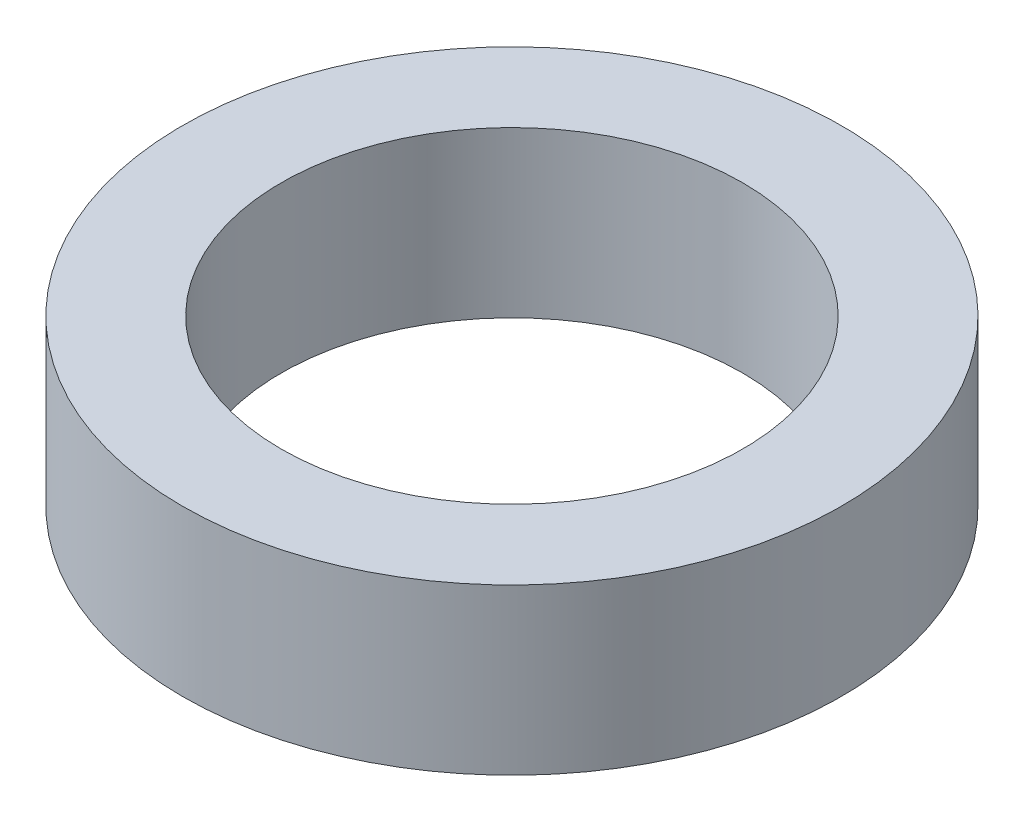
ISO-10303-21;
HEADER;
FILE_DESCRIPTION(('STEP AP214'),'2;1');
FILE_NAME('part.step','',(''),(''),'','','');
FILE_SCHEMA(('AUTOMOTIVE_DESIGN { 1 0 10303 214 1 1 1 1 }'));
ENDSEC;
DATA;
#1=APPLICATION_CONTEXT('core data for automotive mechanical design processes');
#2=APPLICATION_PROTOCOL_DEFINITION('international standard','automotive_design',2000,#1);
#3=PRODUCT_CONTEXT('',#1,'mechanical');
#4=PRODUCT('Part','Part','',(#3));
#5=PRODUCT_RELATED_PRODUCT_CATEGORY('part','',(#4));
#6=PRODUCT_DEFINITION_FORMATION('','',#4);
#7=PRODUCT_DEFINITION_CONTEXT('part definition',#1,'design');
#8=PRODUCT_DEFINITION('design','',#6,#7);
#9=PRODUCT_DEFINITION_SHAPE('','',#8);
#10=(LENGTH_UNIT() NAMED_UNIT(*) SI_UNIT(.MILLI.,.METRE.));
#11=(NAMED_UNIT(*) PLANE_ANGLE_UNIT() SI_UNIT($,.RADIAN.));
#12=(NAMED_UNIT(*) SI_UNIT($,.STERADIAN.) SOLID_ANGLE_UNIT());
#13=UNCERTAINTY_MEASURE_WITH_UNIT(LENGTH_MEASURE(1.E-05),#10,'distance_accuracy_value','');
#14=(GEOMETRIC_REPRESENTATION_CONTEXT(3) GLOBAL_UNCERTAINTY_ASSIGNED_CONTEXT((#13)) GLOBAL_UNIT_ASSIGNED_CONTEXT((#10,
#11,#12)) REPRESENTATION_CONTEXT('',''));
#15=CARTESIAN_POINT('',(0.,0.,0.));
#16=DIRECTION('',(0.,0.,1.));
#17=DIRECTION('',(1.,0.,0.));
#18=AXIS2_PLACEMENT_3D('',#15,#16,#17);
#19=CARTESIAN_POINT('',(0.,25.,0.));
#20=DIRECTION('',(0.,-1.,0.));
#21=DIRECTION('',(0.,0.,-1.));
#22=AXIS2_PLACEMENT_3D('',#19,#20,#21);
#23=CYLINDRICAL_SURFACE('',#22,50.);
#24=CARTESIAN_POINT('',(0.,25.,0.));
#25=DIRECTION('',(0.,1.,0.));
#26=DIRECTION('',(0.,0.,1.));
#27=AXIS2_PLACEMENT_3D('',#24,#25,#26);
#28=CIRCLE('',#27,50.);
#29=CARTESIAN_POINT('',(0.,25.,50.));
#30=VERTEX_POINT('',#29);
#31=EDGE_CURVE('E10',#30,#30,#28,.T.);
#32=ORIENTED_EDGE('',*,*,#31,.F.);
#33=EDGE_LOOP('',(#32));
#34=FACE_BOUND('',#33,.T.);
#35=CARTESIAN_POINT('',(0.,0.,0.));
#36=DIRECTION('',(0.,1.,0.));
#37=DIRECTION('',(0.,0.,1.));
#38=AXIS2_PLACEMENT_3D('',#35,#36,#37);
#39=CIRCLE('',#38,50.);
#40=CARTESIAN_POINT('',(0.,0.,50.));
#41=VERTEX_POINT('',#40);
#42=EDGE_CURVE('E37',#41,#41,#39,.T.);
#43=ORIENTED_EDGE('',*,*,#42,.T.);
#44=EDGE_LOOP('',(#43));
#45=FACE_BOUND('',#44,.T.);
#46=ADVANCED_FACE('F40',(#34,#45),#23,.T.);
#47=CARTESIAN_POINT('',(0.,25.,0.));
#48=DIRECTION('',(0.,1.,0.));
#49=DIRECTION('',(0.,0.,1.));
#50=AXIS2_PLACEMENT_3D('',#47,#48,#49);
#51=PLANE('',#50);
#52=CARTESIAN_POINT('',(0.,25.,0.));
#53=DIRECTION('',(0.,1.,0.));
#54=DIRECTION('',(0.,0.,1.));
#55=AXIS2_PLACEMENT_3D('',#52,#53,#54);
#56=CIRCLE('',#55,35.);
#57=CARTESIAN_POINT('',(0.,25.,35.));
#58=VERTEX_POINT('',#57);
#59=EDGE_CURVE('E50',#58,#58,#56,.T.);
#60=ORIENTED_EDGE('',*,*,#59,.F.);
#61=EDGE_LOOP('',(#60));
#62=FACE_BOUND('',#61,.T.);
#63=ORIENTED_EDGE('',*,*,#31,.T.);
#64=EDGE_LOOP('',(#63));
#65=FACE_BOUND('',#64,.T.);
#66=ADVANCED_FACE('F59',(#62,#65),#51,.T.);
#67=CARTESIAN_POINT('',(0.,0.,0.));
#68=DIRECTION('',(0.,1.,0.));
#69=DIRECTION('',(0.,0.,1.));
#70=AXIS2_PLACEMENT_3D('',#67,#68,#69);
#71=PLANE('',#70);
#72=CARTESIAN_POINT('',(0.,0.,0.));
#73=DIRECTION('',(0.,1.,0.));
#74=DIRECTION('',(0.,0.,1.));
#75=AXIS2_PLACEMENT_3D('',#72,#73,#74);
#76=CIRCLE('',#75,35.);
#77=CARTESIAN_POINT('',(0.,0.,35.));
#78=VERTEX_POINT('',#77);
#79=EDGE_CURVE('E47',#78,#78,#76,.T.);
#80=ORIENTED_EDGE('',*,*,#79,.T.);
#81=EDGE_LOOP('',(#80));
#82=FACE_BOUND('',#81,.T.);
#83=ORIENTED_EDGE('',*,*,#42,.F.);
#84=EDGE_LOOP('',(#83));
#85=FACE_BOUND('',#84,.T.);
#86=ADVANCED_FACE('F58',(#82,#85),#71,.F.);
#87=CARTESIAN_POINT('',(0.,25.,0.));
#88=DIRECTION('',(0.,-1.,0.));
#89=DIRECTION('',(0.,0.,-1.));
#90=AXIS2_PLACEMENT_3D('',#87,#88,#89);
#91=CYLINDRICAL_SURFACE('',#90,35.);
#92=ORIENTED_EDGE('',*,*,#59,.T.);
#93=EDGE_LOOP('',(#92));
#94=FACE_BOUND('',#93,.T.);
#95=ORIENTED_EDGE('',*,*,#79,.F.);
#96=EDGE_LOOP('',(#95));
#97=FACE_BOUND('',#96,.T.);
#98=ADVANCED_FACE('F54',(#94,#97),#91,.F.);
#99=CLOSED_SHELL('',(#46,#66,#86,#98));
#100=MANIFOLD_SOLID_BREP('B2',#99);
#101=ADVANCED_BREP_SHAPE_REPRESENTATION('',(#18,#100),#14);
#102=SHAPE_DEFINITION_REPRESENTATION(#9,#101);
ENDSEC;
END-ISO-10303-21;
